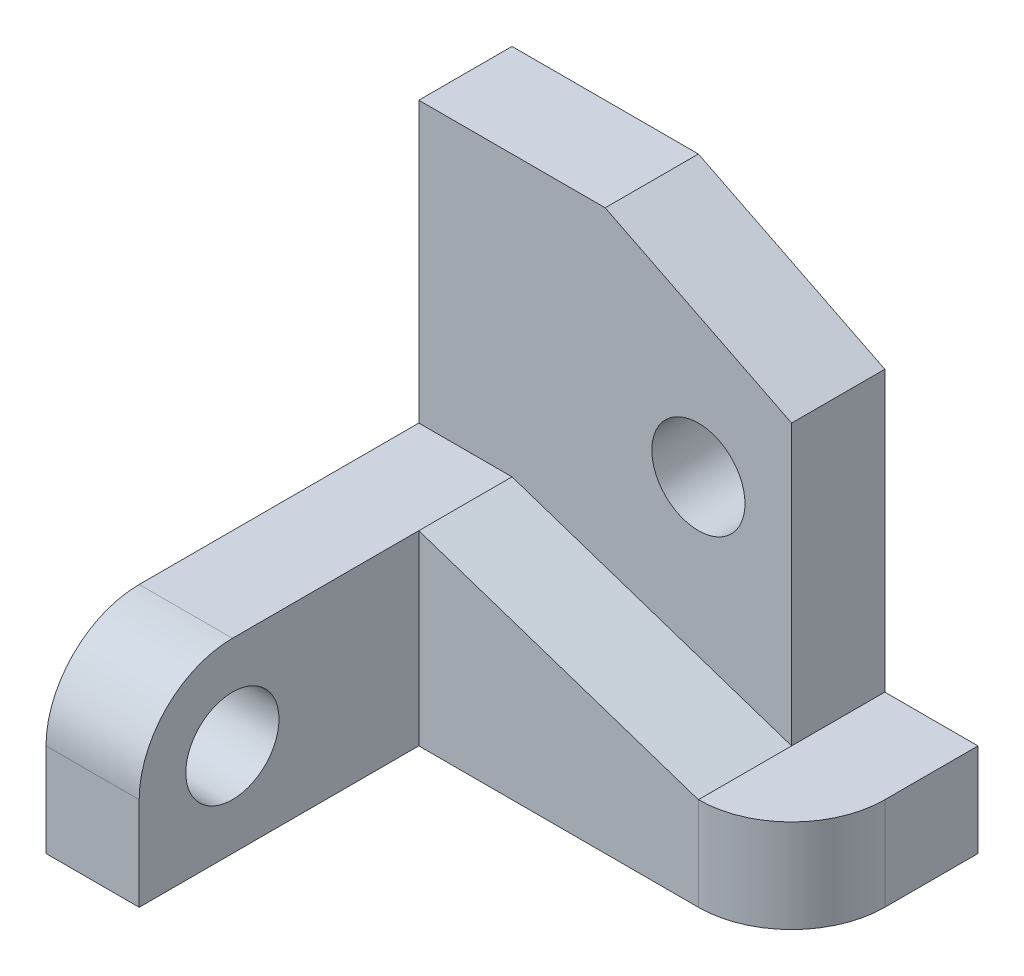
ISO-10303-21;
HEADER;
FILE_DESCRIPTION(('STEP AP214'),'2;1');
FILE_NAME('part.step','',(''),(''),'','','');
FILE_SCHEMA(('AUTOMOTIVE_DESIGN { 1 0 10303 214 1 1 1 1 }'));
ENDSEC;
DATA;
#1=APPLICATION_CONTEXT('core data for automotive mechanical design processes');
#2=APPLICATION_PROTOCOL_DEFINITION('international standard','automotive_design',2000,#1);
#3=PRODUCT_CONTEXT('',#1,'mechanical');
#4=PRODUCT('Part','Part','',(#3));
#5=PRODUCT_RELATED_PRODUCT_CATEGORY('part','',(#4));
#6=PRODUCT_DEFINITION_FORMATION('','',#4);
#7=PRODUCT_DEFINITION_CONTEXT('part definition',#1,'design');
#8=PRODUCT_DEFINITION('design','',#6,#7);
#9=PRODUCT_DEFINITION_SHAPE('','',#8);
#10=(LENGTH_UNIT() NAMED_UNIT(*) SI_UNIT(.MILLI.,.METRE.));
#11=(NAMED_UNIT(*) PLANE_ANGLE_UNIT() SI_UNIT($,.RADIAN.));
#12=(NAMED_UNIT(*) SI_UNIT($,.STERADIAN.) SOLID_ANGLE_UNIT());
#13=UNCERTAINTY_MEASURE_WITH_UNIT(LENGTH_MEASURE(1.E-05),#10,'distance_accuracy_value','');
#14=(GEOMETRIC_REPRESENTATION_CONTEXT(3) GLOBAL_UNCERTAINTY_ASSIGNED_CONTEXT((#13)) GLOBAL_UNIT_ASSIGNED_CONTEXT((#10,
#11,#12)) REPRESENTATION_CONTEXT('',''));
#15=CARTESIAN_POINT('',(0.,0.,0.));
#16=DIRECTION('',(0.,0.,1.));
#17=DIRECTION('',(1.,0.,0.));
#18=AXIS2_PLACEMENT_3D('',#15,#16,#17);
#19=CARTESIAN_POINT('',(20.,10.,0.));
#20=DIRECTION('',(1.,0.,0.));
#21=DIRECTION('',(0.,0.,-1.));
#22=AXIS2_PLACEMENT_3D('',#19,#20,#21);
#23=PLANE('',#22);
#24=DIRECTION('',(0.,-1.,0.));
#25=VECTOR('',#24,1.);
#26=CARTESIAN_POINT('',(20.,25.,-5.));
#27=LINE('',#26,#25);
#28=CARTESIAN_POINT('',(20.,20.,-5.));
#29=VERTEX_POINT('',#28);
#30=CARTESIAN_POINT('',(20.,5.,-5.));
#31=VERTEX_POINT('',#30);
#32=EDGE_CURVE('E198',#29,#31,#27,.T.);
#33=ORIENTED_EDGE('',*,*,#32,.T.);
#34=DIRECTION('',(0.,0.,1.));
#35=VECTOR('',#34,1.);
#36=CARTESIAN_POINT('',(20.,5.,0.));
#37=LINE('',#36,#35);
#38=CARTESIAN_POINT('',(20.,5.,-10.));
#39=VERTEX_POINT('',#38);
#40=EDGE_CURVE('E106',#39,#31,#37,.T.);
#41=ORIENTED_EDGE('',*,*,#40,.F.);
#42=DIRECTION('',(0.,-1.,0.));
#43=VECTOR('',#42,1.);
#44=CARTESIAN_POINT('',(20.,25.,-10.));
#45=LINE('',#44,#43);
#46=CARTESIAN_POINT('',(20.,20.,-10.));
#47=VERTEX_POINT('',#46);
#48=EDGE_CURVE('E229',#47,#39,#45,.T.);
#49=ORIENTED_EDGE('',*,*,#48,.F.);
#50=DIRECTION('',(0.,0.,1.));
#51=VECTOR('',#50,1.);
#52=CARTESIAN_POINT('',(20.,20.,-30.));
#53=LINE('',#52,#51);
#54=EDGE_CURVE('E214',#47,#29,#53,.T.);
#55=ORIENTED_EDGE('',*,*,#54,.T.);
#56=EDGE_LOOP('',(#33,#41,#49,#55));
#57=FACE_BOUND('',#56,.T.);
#58=ADVANCED_FACE('F39',(#57),#23,.T.);
#59=CARTESIAN_POINT('',(20.,5.,-5.));
#60=DIRECTION('',(0.,-1.,0.));
#61=DIRECTION('',(0.,0.,-1.));
#62=AXIS2_PLACEMENT_3D('',#59,#60,#61);
#63=CYLINDRICAL_SURFACE('',#62,5.);
#64=CARTESIAN_POINT('',(20.,0.,-5.));
#65=DIRECTION('',(0.,1.,0.));
#66=DIRECTION('',(0.,0.,1.));
#67=AXIS2_PLACEMENT_3D('',#64,#65,#66);
#68=CIRCLE('',#67,5.);
#69=CARTESIAN_POINT('',(20.,0.,0.));
#70=VERTEX_POINT('',#69);
#71=CARTESIAN_POINT('',(25.,0.,-5.00000000000004));
#72=VERTEX_POINT('',#71);
#73=EDGE_CURVE('E99',#70,#72,#68,.T.);
#74=ORIENTED_EDGE('',*,*,#73,.T.);
#75=DIRECTION('',(0.,-1.,0.));
#76=VECTOR('',#75,1.);
#77=CARTESIAN_POINT('',(25.,5.,-5.00000000000004));
#78=LINE('',#77,#76);
#79=CARTESIAN_POINT('',(25.,5.,-5.00000000000004));
#80=VERTEX_POINT('',#79);
#81=EDGE_CURVE('E90',#80,#72,#78,.T.);
#82=ORIENTED_EDGE('',*,*,#81,.F.);
#83=CARTESIAN_POINT('',(20.,5.,-5.));
#84=DIRECTION('',(0.,1.,0.));
#85=DIRECTION('',(0.,0.,1.));
#86=AXIS2_PLACEMENT_3D('',#83,#84,#85);
#87=CIRCLE('',#86,5.);
#88=CARTESIAN_POINT('',(20.,5.,0.));
#89=VERTEX_POINT('',#88);
#90=EDGE_CURVE('E109',#89,#80,#87,.T.);
#91=ORIENTED_EDGE('',*,*,#90,.F.);
#92=DIRECTION('',(0.,-1.,0.));
#93=VECTOR('',#92,1.);
#94=CARTESIAN_POINT('',(20.,5.,0.));
#95=LINE('',#94,#93);
#96=EDGE_CURVE('E47',#89,#70,#95,.T.);
#97=ORIENTED_EDGE('',*,*,#96,.T.);
#98=EDGE_LOOP('',(#74,#82,#91,#97));
#99=FACE_BOUND('',#98,.T.);
#100=ADVANCED_FACE('F41',(#99),#63,.T.);
#101=CARTESIAN_POINT('',(25.,5.,0.));
#102=DIRECTION('',(-1.,0.,0.));
#103=DIRECTION('',(0.,0.,1.));
#104=AXIS2_PLACEMENT_3D('',#101,#102,#103);
#105=PLANE('',#104);
#106=DIRECTION('',(0.,0.,-1.));
#107=VECTOR('',#106,1.);
#108=CARTESIAN_POINT('',(25.,0.,0.));
#109=LINE('',#108,#107);
#110=CARTESIAN_POINT('',(25.,0.,-10.));
#111=VERTEX_POINT('',#110);
#112=EDGE_CURVE('E94',#72,#111,#109,.T.);
#113=ORIENTED_EDGE('',*,*,#112,.T.);
#114=DIRECTION('',(0.,-1.,0.));
#115=VECTOR('',#114,1.);
#116=CARTESIAN_POINT('',(25.,5.,-10.));
#117=LINE('',#116,#115);
#118=CARTESIAN_POINT('',(25.,5.,-10.));
#119=VERTEX_POINT('',#118);
#120=EDGE_CURVE('E78',#119,#111,#117,.T.);
#121=ORIENTED_EDGE('',*,*,#120,.F.);
#122=DIRECTION('',(0.,0.,-1.));
#123=VECTOR('',#122,1.);
#124=CARTESIAN_POINT('',(25.,5.,0.));
#125=LINE('',#124,#123);
#126=EDGE_CURVE('E62',#80,#119,#125,.T.);
#127=ORIENTED_EDGE('',*,*,#126,.F.);
#128=ORIENTED_EDGE('',*,*,#81,.T.);
#129=EDGE_LOOP('',(#113,#121,#127,#128));
#130=FACE_BOUND('',#129,.T.);
#131=ADVANCED_FACE('F95',(#130),#105,.F.);
#132=CARTESIAN_POINT('',(0.,5.,-10.));
#133=DIRECTION('',(0.,0.,-1.));
#134=DIRECTION('',(-1.,0.,0.));
#135=AXIS2_PLACEMENT_3D('',#132,#133,#134);
#136=PLANE('',#135);
#137=DIRECTION('',(-0.894427190999916,0.447213595499958,0.));
#138=VECTOR('',#137,1.);
#139=CARTESIAN_POINT('',(10.,25.,-10.));
#140=LINE('',#139,#138);
#141=CARTESIAN_POINT('',(10.,25.,-10.));
#142=VERTEX_POINT('',#141);
#143=EDGE_CURVE('E53',#47,#142,#140,.T.);
#144=ORIENTED_EDGE('',*,*,#143,.F.);
#145=ORIENTED_EDGE('',*,*,#48,.T.);
#146=DIRECTION('',(1.,0.,0.));
#147=VECTOR('',#146,1.);
#148=CARTESIAN_POINT('',(0.,5.,-10.));
#149=LINE('',#148,#147);
#150=EDGE_CURVE('E88',#39,#119,#149,.T.);
#151=ORIENTED_EDGE('',*,*,#150,.T.);
#152=ORIENTED_EDGE('',*,*,#120,.T.);
#153=DIRECTION('',(1.,0.,0.));
#154=VECTOR('',#153,1.);
#155=CARTESIAN_POINT('',(0.,0.,-10.));
#156=LINE('',#155,#154);
#157=CARTESIAN_POINT('',(0.,0.,-10.));
#158=VERTEX_POINT('',#157);
#159=EDGE_CURVE('E85',#158,#111,#156,.T.);
#160=ORIENTED_EDGE('',*,*,#159,.F.);
#161=DIRECTION('',(0.,-1.,0.));
#162=VECTOR('',#161,1.);
#163=CARTESIAN_POINT('',(0.,25.,-10.));
#164=LINE('',#163,#162);
#165=CARTESIAN_POINT('',(0.,25.,-10.));
#166=VERTEX_POINT('',#165);
#167=EDGE_CURVE('E185',#166,#158,#164,.T.);
#168=ORIENTED_EDGE('',*,*,#167,.F.);
#169=DIRECTION('',(1.,0.,0.));
#170=VECTOR('',#169,1.);
#171=CARTESIAN_POINT('',(0.,25.,-10.));
#172=LINE('',#171,#170);
#173=EDGE_CURVE('E224',#166,#142,#172,.T.);
#174=ORIENTED_EDGE('',*,*,#173,.T.);
#175=EDGE_LOOP('',(#144,#145,#151,#152,#160,#168,#174));
#176=FACE_BOUND('',#175,.T.);
#177=CARTESIAN_POINT('',(15.,15.,-10.));
#178=DIRECTION('',(0.,0.,-1.));
#179=DIRECTION('',(-1.,0.,0.));
#180=AXIS2_PLACEMENT_3D('',#177,#178,#179);
#181=CIRCLE('',#180,2.5);
#182=CARTESIAN_POINT('',(12.5,15.,-10.));
#183=VERTEX_POINT('',#182);
#184=EDGE_CURVE('E220',#183,#183,#181,.T.);
#185=ORIENTED_EDGE('',*,*,#184,.F.);
#186=EDGE_LOOP('',(#185));
#187=FACE_BOUND('',#186,.T.);
#188=ADVANCED_FACE('F80',(#176,#187),#136,.T.);
#189=CARTESIAN_POINT('',(0.,5.,0.));
#190=DIRECTION('',(0.,1.,0.));
#191=DIRECTION('',(0.,0.,1.));
#192=AXIS2_PLACEMENT_3D('',#189,#190,#191);
#193=PLANE('',#192);
#194=ORIENTED_EDGE('',*,*,#40,.T.);
#195=DIRECTION('',(0.,0.,1.));
#196=VECTOR('',#195,1.);
#197=CARTESIAN_POINT('',(20.,5.,-20.8113883008419));
#198=LINE('',#197,#196);
#199=EDGE_CURVE('E203',#31,#89,#198,.T.);
#200=ORIENTED_EDGE('',*,*,#199,.T.);
#201=ORIENTED_EDGE('',*,*,#90,.T.);
#202=ORIENTED_EDGE('',*,*,#126,.T.);
#203=ORIENTED_EDGE('',*,*,#150,.F.);
#204=EDGE_LOOP('',(#194,#200,#201,#202,#203));
#205=FACE_BOUND('',#204,.T.);
#206=ADVANCED_FACE('F202',(#205),#193,.T.);
#207=CARTESIAN_POINT('',(0.,0.,0.));
#208=DIRECTION('',(0.,1.,0.));
#209=DIRECTION('',(0.,0.,1.));
#210=AXIS2_PLACEMENT_3D('',#207,#208,#209);
#211=PLANE('',#210);
#212=DIRECTION('',(0.,0.,-1.));
#213=VECTOR('',#212,1.);
#214=CARTESIAN_POINT('',(0.,0.,0.));
#215=LINE('',#214,#213);
#216=CARTESIAN_POINT('',(0.,0.,15.));
#217=VERTEX_POINT('',#216);
#218=EDGE_CURVE('E104',#217,#158,#215,.T.);
#219=ORIENTED_EDGE('',*,*,#218,.T.);
#220=ORIENTED_EDGE('',*,*,#159,.T.);
#221=ORIENTED_EDGE('',*,*,#112,.F.);
#222=ORIENTED_EDGE('',*,*,#73,.F.);
#223=DIRECTION('',(1.,0.,0.));
#224=VECTOR('',#223,1.);
#225=CARTESIAN_POINT('',(0.,0.,0.));
#226=LINE('',#225,#224);
#227=CARTESIAN_POINT('',(5.,0.,0.));
#228=VERTEX_POINT('',#227);
#229=EDGE_CURVE('E126',#228,#70,#226,.T.);
#230=ORIENTED_EDGE('',*,*,#229,.F.);
#231=DIRECTION('',(0.,0.,-1.));
#232=VECTOR('',#231,1.);
#233=CARTESIAN_POINT('',(5.,0.,15.));
#234=LINE('',#233,#232);
#235=CARTESIAN_POINT('',(5.,0.,15.));
#236=VERTEX_POINT('',#235);
#237=EDGE_CURVE('E423',#236,#228,#234,.T.);
#238=ORIENTED_EDGE('',*,*,#237,.F.);
#239=DIRECTION('',(-1.,0.,0.));
#240=VECTOR('',#239,1.);
#241=CARTESIAN_POINT('',(5.,0.,15.));
#242=LINE('',#241,#240);
#243=EDGE_CURVE('E426',#236,#217,#242,.T.);
#244=ORIENTED_EDGE('',*,*,#243,.T.);
#245=EDGE_LOOP('',(#219,#220,#221,#222,#230,#238,#244));
#246=FACE_BOUND('',#245,.T.);
#247=ADVANCED_FACE('F101',(#246),#211,.F.);
#248=CARTESIAN_POINT('',(0.,10.,0.));
#249=DIRECTION('',(-1.,0.,0.));
#250=DIRECTION('',(0.,0.,1.));
#251=AXIS2_PLACEMENT_3D('',#248,#249,#250);
#252=PLANE('',#251);
#253=ORIENTED_EDGE('',*,*,#218,.F.);
#254=DIRECTION('',(0.,-1.,0.));
#255=VECTOR('',#254,1.);
#256=CARTESIAN_POINT('',(0.,4.99999999999996,15.));
#257=LINE('',#256,#255);
#258=CARTESIAN_POINT('',(0.,4.99999999999996,15.));
#259=VERTEX_POINT('',#258);
#260=EDGE_CURVE('E414',#259,#217,#257,.T.);
#261=ORIENTED_EDGE('',*,*,#260,.F.);
#262=CARTESIAN_POINT('',(0.,5.,9.99999999999999));
#263=DIRECTION('',(1.,0.,0.));
#264=DIRECTION('',(0.,0.,-1.));
#265=AXIS2_PLACEMENT_3D('',#262,#263,#264);
#266=CIRCLE('',#265,5.);
#267=CARTESIAN_POINT('',(0.,10.,9.99999999999996));
#268=VERTEX_POINT('',#267);
#269=EDGE_CURVE('E193',#268,#259,#266,.T.);
#270=ORIENTED_EDGE('',*,*,#269,.F.);
#271=DIRECTION('',(0.,0.,-1.));
#272=VECTOR('',#271,1.);
#273=CARTESIAN_POINT('',(0.,10.,0.));
#274=LINE('',#273,#272);
#275=CARTESIAN_POINT('',(0.,10.,-5.));
#276=VERTEX_POINT('',#275);
#277=EDGE_CURVE('E168',#268,#276,#274,.T.);
#278=ORIENTED_EDGE('',*,*,#277,.T.);
#279=DIRECTION('',(0.,-1.,0.));
#280=VECTOR('',#279,1.);
#281=CARTESIAN_POINT('',(0.,25.,-5.));
#282=LINE('',#281,#280);
#283=CARTESIAN_POINT('',(0.,25.,-5.));
#284=VERTEX_POINT('',#283);
#285=EDGE_CURVE('E176',#284,#276,#282,.T.);
#286=ORIENTED_EDGE('',*,*,#285,.F.);
#287=DIRECTION('',(0.,0.,-1.));
#288=VECTOR('',#287,1.);
#289=CARTESIAN_POINT('',(0.,25.,0.));
#290=LINE('',#289,#288);
#291=EDGE_CURVE('E186',#284,#166,#290,.T.);
#292=ORIENTED_EDGE('',*,*,#291,.T.);
#293=ORIENTED_EDGE('',*,*,#167,.T.);
#294=EDGE_LOOP('',(#253,#261,#270,#278,#286,#292,#293));
#295=FACE_BOUND('',#294,.T.);
#296=CARTESIAN_POINT('',(0.,5.,9.99999999999999));
#297=DIRECTION('',(1.,0.,0.));
#298=DIRECTION('',(0.,0.,-1.));
#299=AXIS2_PLACEMENT_3D('',#296,#297,#298);
#300=CIRCLE('',#299,2.5);
#301=CARTESIAN_POINT('',(0.,5.,7.49999999999999));
#302=VERTEX_POINT('',#301);
#303=EDGE_CURVE('E407',#302,#302,#300,.T.);
#304=ORIENTED_EDGE('',*,*,#303,.T.);
#305=EDGE_LOOP('',(#304));
#306=FACE_BOUND('',#305,.T.);
#307=ADVANCED_FACE('F189',(#295,#306),#252,.T.);
#308=CARTESIAN_POINT('',(0.,10.,0.));
#309=DIRECTION('',(0.,0.,-1.));
#310=DIRECTION('',(-1.,0.,0.));
#311=AXIS2_PLACEMENT_3D('',#308,#309,#310);
#312=PLANE('',#311);
#313=DIRECTION('',(0.948683298050514,-0.316227766016838,0.));
#314=VECTOR('',#313,1.);
#315=CARTESIAN_POINT('',(20.,5.,0.));
#316=LINE('',#315,#314);
#317=CARTESIAN_POINT('',(5.,10.,0.));
#318=VERTEX_POINT('',#317);
#319=EDGE_CURVE('E124',#318,#89,#316,.T.);
#320=ORIENTED_EDGE('',*,*,#319,.F.);
#321=DIRECTION('',(0.,1.,0.));
#322=VECTOR('',#321,1.);
#323=CARTESIAN_POINT('',(5.,10.,0.));
#324=LINE('',#323,#322);
#325=EDGE_CURVE('E411',#228,#318,#324,.T.);
#326=ORIENTED_EDGE('',*,*,#325,.F.);
#327=ORIENTED_EDGE('',*,*,#229,.T.);
#328=ORIENTED_EDGE('',*,*,#96,.F.);
#329=EDGE_LOOP('',(#320,#326,#327,#328));
#330=FACE_BOUND('',#329,.T.);
#331=ADVANCED_FACE('F120',(#330),#312,.F.);
#332=CARTESIAN_POINT('',(0.,10.,0.));
#333=DIRECTION('',(0.,1.,0.));
#334=DIRECTION('',(0.,0.,1.));
#335=AXIS2_PLACEMENT_3D('',#332,#333,#334);
#336=PLANE('',#335);
#337=DIRECTION('',(0.,0.,1.));
#338=VECTOR('',#337,1.);
#339=CARTESIAN_POINT('',(5.,10.,-20.8113883008419));
#340=LINE('',#339,#338);
#341=CARTESIAN_POINT('',(5.,10.,-5.));
#342=VERTEX_POINT('',#341);
#343=EDGE_CURVE('E171',#342,#318,#340,.T.);
#344=ORIENTED_EDGE('',*,*,#343,.F.);
#345=DIRECTION('',(-1.,0.,0.));
#346=VECTOR('',#345,1.);
#347=CARTESIAN_POINT('',(0.,10.,-5.));
#348=LINE('',#347,#346);
#349=EDGE_CURVE('E162',#342,#276,#348,.T.);
#350=ORIENTED_EDGE('',*,*,#349,.T.);
#351=ORIENTED_EDGE('',*,*,#277,.F.);
#352=DIRECTION('',(-1.,0.,0.));
#353=VECTOR('',#352,1.);
#354=CARTESIAN_POINT('',(5.,10.,9.99999999999996));
#355=LINE('',#354,#353);
#356=CARTESIAN_POINT('',(5.,10.,9.99999999999996));
#357=VERTEX_POINT('',#356);
#358=EDGE_CURVE('E434',#357,#268,#355,.T.);
#359=ORIENTED_EDGE('',*,*,#358,.F.);
#360=DIRECTION('',(0.,0.,1.));
#361=VECTOR('',#360,1.);
#362=CARTESIAN_POINT('',(5.,10.,0.));
#363=LINE('',#362,#361);
#364=EDGE_CURVE('E413',#318,#357,#363,.T.);
#365=ORIENTED_EDGE('',*,*,#364,.F.);
#366=EDGE_LOOP('',(#344,#350,#351,#359,#365));
#367=FACE_BOUND('',#366,.T.);
#368=ADVANCED_FACE('F164',(#367),#336,.T.);
#369=CARTESIAN_POINT('',(0.,25.,-5.));
#370=DIRECTION('',(0.,0.,1.));
#371=DIRECTION('',(1.,0.,0.));
#372=AXIS2_PLACEMENT_3D('',#369,#370,#371);
#373=PLANE('',#372);
#374=DIRECTION('',(0.894427190999916,-0.447213595499958,0.));
#375=VECTOR('',#374,1.);
#376=CARTESIAN_POINT('',(10.,25.,-5.));
#377=LINE('',#376,#375);
#378=CARTESIAN_POINT('',(10.,25.,-5.));
#379=VERTEX_POINT('',#378);
#380=EDGE_CURVE('E212',#379,#29,#377,.T.);
#381=ORIENTED_EDGE('',*,*,#380,.F.);
#382=DIRECTION('',(-1.,0.,0.));
#383=VECTOR('',#382,1.);
#384=CARTESIAN_POINT('',(0.,25.,-5.));
#385=LINE('',#384,#383);
#386=EDGE_CURVE('E181',#379,#284,#385,.T.);
#387=ORIENTED_EDGE('',*,*,#386,.T.);
#388=ORIENTED_EDGE('',*,*,#285,.T.);
#389=ORIENTED_EDGE('',*,*,#349,.F.);
#390=DIRECTION('',(-0.948683298050514,0.316227766016838,0.));
#391=VECTOR('',#390,1.);
#392=CARTESIAN_POINT('',(20.,5.,-5.));
#393=LINE('',#392,#391);
#394=EDGE_CURVE('E205',#31,#342,#393,.T.);
#395=ORIENTED_EDGE('',*,*,#394,.F.);
#396=ORIENTED_EDGE('',*,*,#32,.F.);
#397=EDGE_LOOP('',(#381,#387,#388,#389,#395,#396));
#398=FACE_BOUND('',#397,.T.);
#399=CARTESIAN_POINT('',(15.,15.,-5.));
#400=DIRECTION('',(0.,0.,1.));
#401=DIRECTION('',(1.,0.,0.));
#402=AXIS2_PLACEMENT_3D('',#399,#400,#401);
#403=CIRCLE('',#402,2.5);
#404=CARTESIAN_POINT('',(17.5,15.,-5.));
#405=VERTEX_POINT('',#404);
#406=EDGE_CURVE('E207',#405,#405,#403,.T.);
#407=ORIENTED_EDGE('',*,*,#406,.F.);
#408=EDGE_LOOP('',(#407));
#409=FACE_BOUND('',#408,.T.);
#410=ADVANCED_FACE('F178',(#398,#409),#373,.T.);
#411=CARTESIAN_POINT('',(0.,25.,0.));
#412=DIRECTION('',(0.,1.,0.));
#413=DIRECTION('',(0.,0.,1.));
#414=AXIS2_PLACEMENT_3D('',#411,#412,#413);
#415=PLANE('',#414);
#416=DIRECTION('',(0.,0.,1.));
#417=VECTOR('',#416,1.);
#418=CARTESIAN_POINT('',(10.,25.,0.));
#419=LINE('',#418,#417);
#420=EDGE_CURVE('E11',#142,#379,#419,.T.);
#421=ORIENTED_EDGE('',*,*,#420,.F.);
#422=ORIENTED_EDGE('',*,*,#173,.F.);
#423=ORIENTED_EDGE('',*,*,#291,.F.);
#424=ORIENTED_EDGE('',*,*,#386,.F.);
#425=EDGE_LOOP('',(#421,#422,#423,#424));
#426=FACE_BOUND('',#425,.T.);
#427=ADVANCED_FACE('F303',(#426),#415,.T.);
#428=CARTESIAN_POINT('',(10.,25.,-30.));
#429=DIRECTION('',(-0.447213595499958,-0.894427190999916,0.));
#430=DIRECTION('',(0.894427190999916,-0.447213595499958,0.));
#431=AXIS2_PLACEMENT_3D('',#428,#429,#430);
#432=PLANE('',#431);
#433=ORIENTED_EDGE('',*,*,#143,.T.);
#434=ORIENTED_EDGE('',*,*,#420,.T.);
#435=ORIENTED_EDGE('',*,*,#380,.T.);
#436=ORIENTED_EDGE('',*,*,#54,.F.);
#437=EDGE_LOOP('',(#433,#434,#435,#436));
#438=FACE_BOUND('',#437,.T.);
#439=ADVANCED_FACE('F245',(#438),#432,.F.);
#440=CARTESIAN_POINT('',(15.,15.,-30.));
#441=DIRECTION('',(0.,0.,1.));
#442=DIRECTION('',(1.,0.,0.));
#443=AXIS2_PLACEMENT_3D('',#440,#441,#442);
#444=CYLINDRICAL_SURFACE('',#443,2.5);
#445=ORIENTED_EDGE('',*,*,#184,.T.);
#446=EDGE_LOOP('',(#445));
#447=FACE_BOUND('',#446,.T.);
#448=ORIENTED_EDGE('',*,*,#406,.T.);
#449=EDGE_LOOP('',(#448));
#450=FACE_BOUND('',#449,.T.);
#451=ADVANCED_FACE('F236',(#447,#450),#444,.F.);
#452=CARTESIAN_POINT('',(20.,5.,-20.8113883008419));
#453=DIRECTION('',(-0.316227766016838,-0.948683298050514,0.));
#454=DIRECTION('',(0.948683298050514,-0.316227766016838,0.));
#455=AXIS2_PLACEMENT_3D('',#452,#453,#454);
#456=PLANE('',#455);
#457=ORIENTED_EDGE('',*,*,#394,.T.);
#458=ORIENTED_EDGE('',*,*,#343,.T.);
#459=ORIENTED_EDGE('',*,*,#319,.T.);
#460=ORIENTED_EDGE('',*,*,#199,.F.);
#461=EDGE_LOOP('',(#457,#458,#459,#460));
#462=FACE_BOUND('',#461,.T.);
#463=ADVANCED_FACE('F233',(#462),#456,.F.);
#464=CARTESIAN_POINT('',(5.,5.,9.99999999999999));
#465=DIRECTION('',(1.,0.,0.));
#466=DIRECTION('',(0.,0.,-1.));
#467=AXIS2_PLACEMENT_3D('',#464,#465,#466);
#468=PLANE('',#467);
#469=ORIENTED_EDGE('',*,*,#325,.T.);
#470=ORIENTED_EDGE('',*,*,#364,.T.);
#471=CARTESIAN_POINT('',(5.,5.,9.99999999999999));
#472=DIRECTION('',(1.,0.,0.));
#473=DIRECTION('',(0.,0.,-1.));
#474=AXIS2_PLACEMENT_3D('',#471,#472,#473);
#475=CIRCLE('',#474,5.);
#476=CARTESIAN_POINT('',(5.,4.99999999999996,15.));
#477=VERTEX_POINT('',#476);
#478=EDGE_CURVE('E417',#357,#477,#475,.T.);
#479=ORIENTED_EDGE('',*,*,#478,.T.);
#480=DIRECTION('',(0.,-1.,0.));
#481=VECTOR('',#480,1.);
#482=CARTESIAN_POINT('',(5.,4.99999999999996,15.));
#483=LINE('',#482,#481);
#484=EDGE_CURVE('E420',#477,#236,#483,.T.);
#485=ORIENTED_EDGE('',*,*,#484,.T.);
#486=ORIENTED_EDGE('',*,*,#237,.T.);
#487=EDGE_LOOP('',(#469,#470,#479,#485,#486));
#488=FACE_BOUND('',#487,.T.);
#489=CARTESIAN_POINT('',(5.,5.,9.99999999999999));
#490=DIRECTION('',(1.,0.,0.));
#491=DIRECTION('',(0.,0.,-1.));
#492=AXIS2_PLACEMENT_3D('',#489,#490,#491);
#493=CIRCLE('',#492,2.5);
#494=CARTESIAN_POINT('',(5.,5.,7.49999999999999));
#495=VERTEX_POINT('',#494);
#496=EDGE_CURVE('E404',#495,#495,#493,.T.);
#497=ORIENTED_EDGE('',*,*,#496,.F.);
#498=EDGE_LOOP('',(#497));
#499=FACE_BOUND('',#498,.T.);
#500=ADVANCED_FACE('F235',(#488,#499),#468,.T.);
#501=CARTESIAN_POINT('',(5.,5.,9.99999999999999));
#502=DIRECTION('',(-1.,0.,0.));
#503=DIRECTION('',(0.,0.,1.));
#504=AXIS2_PLACEMENT_3D('',#501,#502,#503);
#505=CYLINDRICAL_SURFACE('',#504,5.);
#506=ORIENTED_EDGE('',*,*,#269,.T.);
#507=DIRECTION('',(-1.,0.,0.));
#508=VECTOR('',#507,1.);
#509=CARTESIAN_POINT('',(5.,4.99999999999996,15.));
#510=LINE('',#509,#508);
#511=EDGE_CURVE('E431',#477,#259,#510,.T.);
#512=ORIENTED_EDGE('',*,*,#511,.F.);
#513=ORIENTED_EDGE('',*,*,#478,.F.);
#514=ORIENTED_EDGE('',*,*,#358,.T.);
#515=EDGE_LOOP('',(#506,#512,#513,#514));
#516=FACE_BOUND('',#515,.T.);
#517=ADVANCED_FACE('F242',(#516),#505,.T.);
#518=CARTESIAN_POINT('',(5.,4.99999999999996,15.));
#519=DIRECTION('',(0.,0.,-1.));
#520=DIRECTION('',(-1.,0.,0.));
#521=AXIS2_PLACEMENT_3D('',#518,#519,#520);
#522=PLANE('',#521);
#523=ORIENTED_EDGE('',*,*,#260,.T.);
#524=ORIENTED_EDGE('',*,*,#243,.F.);
#525=ORIENTED_EDGE('',*,*,#484,.F.);
#526=ORIENTED_EDGE('',*,*,#511,.T.);
#527=EDGE_LOOP('',(#523,#524,#525,#526));
#528=FACE_BOUND('',#527,.T.);
#529=ADVANCED_FACE('F378',(#528),#522,.F.);
#530=CARTESIAN_POINT('',(5.,5.,9.99999999999999));
#531=DIRECTION('',(-1.,0.,0.));
#532=DIRECTION('',(0.,0.,1.));
#533=AXIS2_PLACEMENT_3D('',#530,#531,#532);
#534=CYLINDRICAL_SURFACE('',#533,2.5);
#535=ORIENTED_EDGE('',*,*,#496,.T.);
#536=EDGE_LOOP('',(#535));
#537=FACE_BOUND('',#536,.T.);
#538=ORIENTED_EDGE('',*,*,#303,.F.);
#539=EDGE_LOOP('',(#538));
#540=FACE_BOUND('',#539,.T.);
#541=ADVANCED_FACE('F386',(#537,#540),#534,.F.);
#542=CLOSED_SHELL('',(#58,#100,#131,#188,#206,#247,#307,#331,#368,#410,#427,#439,#451,#463,#500,
#517,#529,#541));
#543=MANIFOLD_SOLID_BREP('B2',#542);
#544=ADVANCED_BREP_SHAPE_REPRESENTATION('',(#18,#543),#14);
#545=SHAPE_DEFINITION_REPRESENTATION(#9,#544);
ENDSEC;
END-ISO-10303-21;
